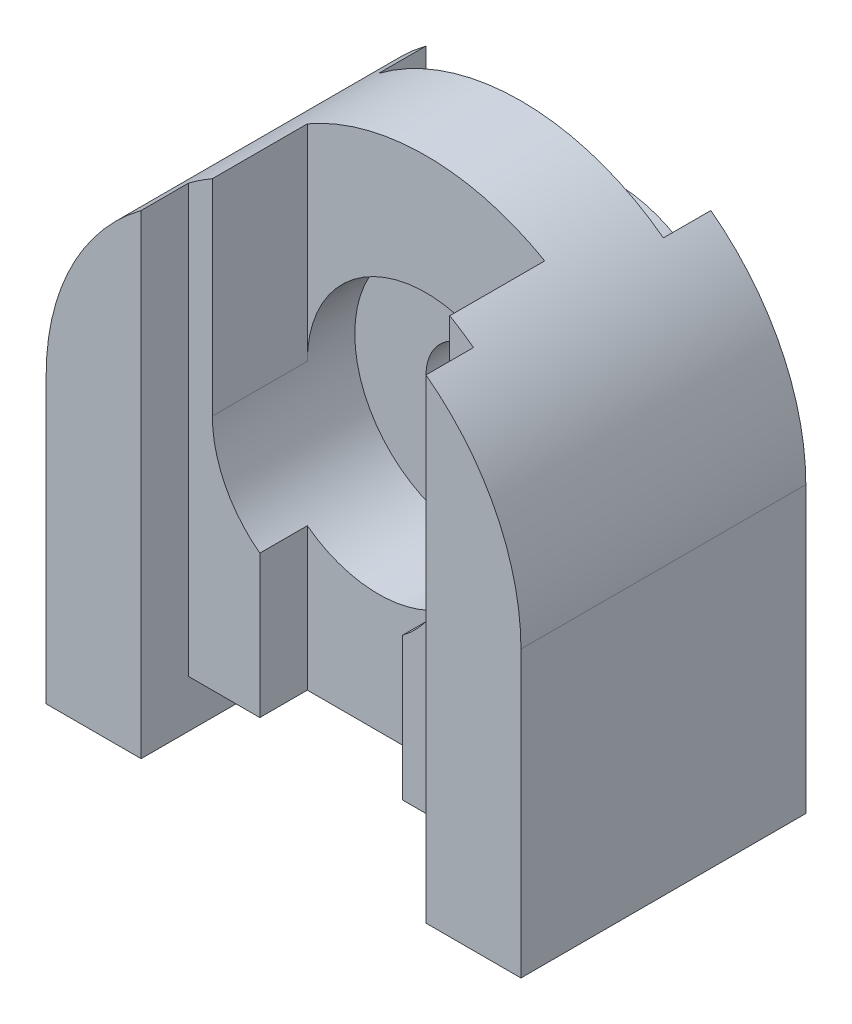
ISO-10303-21;
HEADER;
FILE_DESCRIPTION(('STEP AP214'),'2;1');
FILE_NAME('part.step','',(''),(''),'','','');
FILE_SCHEMA(('AUTOMOTIVE_DESIGN { 1 0 10303 214 1 1 1 1 }'));
ENDSEC;
DATA;
#1=APPLICATION_CONTEXT('core data for automotive mechanical design processes');
#2=APPLICATION_PROTOCOL_DEFINITION('international standard','automotive_design',2000,#1);
#3=PRODUCT_CONTEXT('',#1,'mechanical');
#4=PRODUCT('Part','Part','',(#3));
#5=PRODUCT_RELATED_PRODUCT_CATEGORY('part','',(#4));
#6=PRODUCT_DEFINITION_FORMATION('','',#4);
#7=PRODUCT_DEFINITION_CONTEXT('part definition',#1,'design');
#8=PRODUCT_DEFINITION('design','',#6,#7);
#9=PRODUCT_DEFINITION_SHAPE('','',#8);
#10=(LENGTH_UNIT() NAMED_UNIT(*) SI_UNIT(.MILLI.,.METRE.));
#11=(NAMED_UNIT(*) PLANE_ANGLE_UNIT() SI_UNIT($,.RADIAN.));
#12=(NAMED_UNIT(*) SI_UNIT($,.STERADIAN.) SOLID_ANGLE_UNIT());
#13=UNCERTAINTY_MEASURE_WITH_UNIT(LENGTH_MEASURE(1.E-05),#10,'distance_accuracy_value','');
#14=(GEOMETRIC_REPRESENTATION_CONTEXT(3) GLOBAL_UNCERTAINTY_ASSIGNED_CONTEXT((#13)) GLOBAL_UNIT_ASSIGNED_CONTEXT((#10,
#11,#12)) REPRESENTATION_CONTEXT('',''));
#15=CARTESIAN_POINT('',(0.,0.,0.));
#16=DIRECTION('',(0.,0.,1.));
#17=DIRECTION('',(1.,0.,0.));
#18=AXIS2_PLACEMENT_3D('',#15,#16,#17);
#19=CARTESIAN_POINT('',(20.,140.,60.));
#20=DIRECTION('',(0.,0.,-1.));
#21=DIRECTION('',(-1.,0.,0.));
#22=AXIS2_PLACEMENT_3D('',#19,#20,#21);
#23=PLANE('',#22);
#24=DIRECTION('',(1.,0.,0.));
#25=VECTOR('',#24,1.);
#26=CARTESIAN_POINT('',(20.,10.,60.));
#27=LINE('',#26,#25);
#28=CARTESIAN_POINT('',(20.,10.,60.));
#29=VERTEX_POINT('',#28);
#30=CARTESIAN_POINT('',(35.,10.,60.));
#31=VERTEX_POINT('',#30);
#32=EDGE_CURVE('E204',#29,#31,#27,.T.);
#33=ORIENTED_EDGE('',*,*,#32,.T.);
#34=DIRECTION('',(0.,1.,0.));
#35=VECTOR('',#34,1.);
#36=CARTESIAN_POINT('',(35.,140.,60.));
#37=LINE('',#36,#35);
#38=CARTESIAN_POINT('',(35.,40.,60.));
#39=VERTEX_POINT('',#38);
#40=EDGE_CURVE('E11',#31,#39,#37,.T.);
#41=ORIENTED_EDGE('',*,*,#40,.T.);
#42=CARTESIAN_POINT('',(50.,60.,60.));
#43=DIRECTION('',(0.,0.,-1.));
#44=DIRECTION('',(-1.,0.,0.));
#45=AXIS2_PLACEMENT_3D('',#42,#43,#44);
#46=CIRCLE('',#45,25.);
#47=CARTESIAN_POINT('',(25.,60.,60.));
#48=VERTEX_POINT('',#47);
#49=EDGE_CURVE('E212',#48,#39,#46,.F.);
#50=ORIENTED_EDGE('',*,*,#49,.F.);
#51=DIRECTION('',(0.,1.,0.));
#52=VECTOR('',#51,1.);
#53=CARTESIAN_POINT('',(25.,0.,60.));
#54=LINE('',#53,#52);
#55=CARTESIAN_POINT('',(25.,103.301270189222,60.));
#56=VERTEX_POINT('',#55);
#57=EDGE_CURVE('E216',#48,#56,#54,.T.);
#58=ORIENTED_EDGE('',*,*,#57,.T.);
#59=CARTESIAN_POINT('',(50.,60.,60.));
#60=DIRECTION('',(0.,0.,-1.));
#61=DIRECTION('',(-1.,0.,0.));
#62=AXIS2_PLACEMENT_3D('',#59,#60,#61);
#63=CIRCLE('',#62,50.);
#64=CARTESIAN_POINT('',(20.,100.,60.));
#65=VERTEX_POINT('',#64);
#66=EDGE_CURVE('E217',#65,#56,#63,.T.);
#67=ORIENTED_EDGE('',*,*,#66,.F.);
#68=DIRECTION('',(0.,-1.,0.));
#69=VECTOR('',#68,1.);
#70=CARTESIAN_POINT('',(20.,140.,60.));
#71=LINE('',#70,#69);
#72=EDGE_CURVE('E206',#65,#29,#71,.T.);
#73=ORIENTED_EDGE('',*,*,#72,.T.);
#74=EDGE_LOOP('',(#33,#41,#50,#58,#67,#73));
#75=FACE_BOUND('',#74,.T.);
#76=ADVANCED_FACE('F33',(#75),#23,.F.);
#77=CARTESIAN_POINT('',(0.,0.,70.));
#78=DIRECTION('',(0.,0.,-1.));
#79=DIRECTION('',(-1.,0.,0.));
#80=AXIS2_PLACEMENT_3D('',#77,#78,#79);
#81=PLANE('',#80);
#82=DIRECTION('',(0.,-1.,0.));
#83=VECTOR('',#82,1.);
#84=CARTESIAN_POINT('',(20.,0.,70.));
#85=LINE('',#84,#83);
#86=CARTESIAN_POINT('',(20.,100.,70.));
#87=VERTEX_POINT('',#86);
#88=CARTESIAN_POINT('',(20.,0.,70.));
#89=VERTEX_POINT('',#88);
#90=EDGE_CURVE('E302',#87,#89,#85,.T.);
#91=ORIENTED_EDGE('',*,*,#90,.F.);
#92=CARTESIAN_POINT('',(50.,60.,70.));
#93=DIRECTION('',(0.,0.,1.));
#94=DIRECTION('',(1.,0.,0.));
#95=AXIS2_PLACEMENT_3D('',#92,#93,#94);
#96=CIRCLE('',#95,50.);
#97=CARTESIAN_POINT('',(0.,60.,70.));
#98=VERTEX_POINT('',#97);
#99=EDGE_CURVE('E297',#98,#87,#96,.F.);
#100=ORIENTED_EDGE('',*,*,#99,.F.);
#101=DIRECTION('',(0.,-1.,0.));
#102=VECTOR('',#101,1.);
#103=CARTESIAN_POINT('',(0.,0.,70.));
#104=LINE('',#103,#102);
#105=CARTESIAN_POINT('',(0.,0.,70.));
#106=VERTEX_POINT('',#105);
#107=EDGE_CURVE('E311',#98,#106,#104,.T.);
#108=ORIENTED_EDGE('',*,*,#107,.T.);
#109=DIRECTION('',(1.,0.,0.));
#110=VECTOR('',#109,1.);
#111=CARTESIAN_POINT('',(0.,0.,70.));
#112=LINE('',#111,#110);
#113=EDGE_CURVE('E320',#106,#89,#112,.T.);
#114=ORIENTED_EDGE('',*,*,#113,.T.);
#115=EDGE_LOOP('',(#91,#100,#108,#114));
#116=FACE_BOUND('',#115,.T.);
#117=ADVANCED_FACE('F369',(#116),#81,.F.);
#118=CARTESIAN_POINT('',(80.,100.,70.));
#119=VERTEX_POINT('',#118);
#120=CARTESIAN_POINT('',(100.,60.,70.));
#121=VERTEX_POINT('',#120);
#122=EDGE_CURVE('E296',#119,#121,#96,.F.);
#123=ORIENTED_EDGE('',*,*,#122,.F.);
#124=DIRECTION('',(0.,1.,0.));
#125=VECTOR('',#124,1.);
#126=CARTESIAN_POINT('',(80.,0.,70.));
#127=LINE('',#126,#125);
#128=CARTESIAN_POINT('',(80.,0.,70.));
#129=VERTEX_POINT('',#128);
#130=EDGE_CURVE('E305',#129,#119,#127,.T.);
#131=ORIENTED_EDGE('',*,*,#130,.F.);
#132=CARTESIAN_POINT('',(100.,0.,70.));
#133=VERTEX_POINT('',#132);
#134=EDGE_CURVE('E319',#129,#133,#112,.T.);
#135=ORIENTED_EDGE('',*,*,#134,.T.);
#136=DIRECTION('',(0.,1.,0.));
#137=VECTOR('',#136,1.);
#138=CARTESIAN_POINT('',(100.,0.,70.));
#139=LINE('',#138,#137);
#140=EDGE_CURVE('E323',#133,#121,#139,.T.);
#141=ORIENTED_EDGE('',*,*,#140,.T.);
#142=EDGE_LOOP('',(#123,#131,#135,#141));
#143=FACE_BOUND('',#142,.T.);
#144=ADVANCED_FACE('F375',(#143),#81,.F.);
#145=CARTESIAN_POINT('',(50.,60.,0.));
#146=DIRECTION('',(0.,0.,1.));
#147=DIRECTION('',(1.,0.,0.));
#148=AXIS2_PLACEMENT_3D('',#145,#146,#147);
#149=CYLINDRICAL_SURFACE('',#148,50.);
#150=ORIENTED_EDGE('',*,*,#99,.T.);
#151=DIRECTION('',(0.,0.,1.));
#152=VECTOR('',#151,1.);
#153=CARTESIAN_POINT('',(20.,100.,0.));
#154=LINE('',#153,#152);
#155=EDGE_CURVE('E222',#87,#65,#154,.F.);
#156=ORIENTED_EDGE('',*,*,#155,.T.);
#157=ORIENTED_EDGE('',*,*,#66,.T.);
#158=DIRECTION('',(0.,0.,1.));
#159=VECTOR('',#158,1.);
#160=CARTESIAN_POINT('',(25.,103.301270189222,40.));
#161=LINE('',#160,#159);
#162=CARTESIAN_POINT('',(25.,103.301270189222,40.));
#163=VERTEX_POINT('',#162);
#164=EDGE_CURVE('E241',#163,#56,#161,.T.);
#165=ORIENTED_EDGE('',*,*,#164,.F.);
#166=CARTESIAN_POINT('',(50.,60.,40.));
#167=DIRECTION('',(0.,0.,1.));
#168=DIRECTION('',(1.,0.,0.));
#169=AXIS2_PLACEMENT_3D('',#166,#167,#168);
#170=CIRCLE('',#169,50.);
#171=CARTESIAN_POINT('',(75.,103.301270189222,40.));
#172=VERTEX_POINT('',#171);
#173=EDGE_CURVE('E231',#172,#163,#170,.T.);
#174=ORIENTED_EDGE('',*,*,#173,.F.);
#175=DIRECTION('',(0.,0.,1.));
#176=VECTOR('',#175,1.);
#177=CARTESIAN_POINT('',(75.,103.301270189222,40.));
#178=LINE('',#177,#176);
#179=CARTESIAN_POINT('',(75.,103.301270189222,60.));
#180=VERTEX_POINT('',#179);
#181=EDGE_CURVE('E244',#172,#180,#178,.T.);
#182=ORIENTED_EDGE('',*,*,#181,.T.);
#183=CARTESIAN_POINT('',(80.,100.,60.));
#184=VERTEX_POINT('',#183);
#185=EDGE_CURVE('E56',#180,#184,#63,.T.);
#186=ORIENTED_EDGE('',*,*,#185,.T.);
#187=DIRECTION('',(0.,0.,1.));
#188=VECTOR('',#187,1.);
#189=CARTESIAN_POINT('',(80.,100.,0.));
#190=LINE('',#189,#188);
#191=EDGE_CURVE('E219',#184,#119,#190,.T.);
#192=ORIENTED_EDGE('',*,*,#191,.T.);
#193=ORIENTED_EDGE('',*,*,#122,.T.);
#194=DIRECTION('',(0.,0.,1.));
#195=VECTOR('',#194,1.);
#196=CARTESIAN_POINT('',(100.,60.,0.));
#197=LINE('',#196,#195);
#198=CARTESIAN_POINT('',(100.,60.,10.));
#199=VERTEX_POINT('',#198);
#200=EDGE_CURVE('E293',#199,#121,#197,.T.);
#201=ORIENTED_EDGE('',*,*,#200,.F.);
#202=CARTESIAN_POINT('',(50.,60.,10.));
#203=DIRECTION('',(0.,0.,1.));
#204=DIRECTION('',(1.,0.,0.));
#205=AXIS2_PLACEMENT_3D('',#202,#203,#204);
#206=CIRCLE('',#205,50.);
#207=CARTESIAN_POINT('',(80.,100.,10.));
#208=VERTEX_POINT('',#207);
#209=EDGE_CURVE('E285',#199,#208,#206,.T.);
#210=ORIENTED_EDGE('',*,*,#209,.T.);
#211=DIRECTION('',(0.,0.,1.));
#212=VECTOR('',#211,1.);
#213=CARTESIAN_POINT('',(80.,100.,0.));
#214=LINE('',#213,#212);
#215=CARTESIAN_POINT('',(80.,100.,20.));
#216=VERTEX_POINT('',#215);
#217=EDGE_CURVE('E270',#208,#216,#214,.T.);
#218=ORIENTED_EDGE('',*,*,#217,.T.);
#219=CARTESIAN_POINT('',(50.,60.,20.));
#220=DIRECTION('',(0.,0.,1.));
#221=DIRECTION('',(1.,0.,0.));
#222=AXIS2_PLACEMENT_3D('',#219,#220,#221);
#223=CIRCLE('',#222,50.);
#224=CARTESIAN_POINT('',(20.,100.,20.));
#225=VERTEX_POINT('',#224);
#226=EDGE_CURVE('E266',#216,#225,#223,.T.);
#227=ORIENTED_EDGE('',*,*,#226,.T.);
#228=DIRECTION('',(0.,0.,1.));
#229=VECTOR('',#228,1.);
#230=CARTESIAN_POINT('',(20.,100.,0.));
#231=LINE('',#230,#229);
#232=CARTESIAN_POINT('',(20.,100.,10.));
#233=VERTEX_POINT('',#232);
#234=EDGE_CURVE('E273',#225,#233,#231,.F.);
#235=ORIENTED_EDGE('',*,*,#234,.T.);
#236=CARTESIAN_POINT('',(0.,60.,10.));
#237=VERTEX_POINT('',#236);
#238=EDGE_CURVE('E283',#233,#237,#206,.T.);
#239=ORIENTED_EDGE('',*,*,#238,.T.);
#240=DIRECTION('',(0.,0.,1.));
#241=VECTOR('',#240,1.);
#242=CARTESIAN_POINT('',(0.,60.,0.));
#243=LINE('',#242,#241);
#244=EDGE_CURVE('E300',#237,#98,#243,.T.);
#245=ORIENTED_EDGE('',*,*,#244,.T.);
#246=EDGE_LOOP('',(#150,#156,#157,#165,#174,#182,#186,#192,#193,#201,#210,#218,#227,#235,#239,#245));
#247=FACE_BOUND('',#246,.T.);
#248=ADVANCED_FACE('F346',(#247),#149,.T.);
#249=CARTESIAN_POINT('',(50.,60.,30.));
#250=DIRECTION('',(0.,0.,1.));
#251=DIRECTION('',(1.,0.,0.));
#252=AXIS2_PLACEMENT_3D('',#249,#250,#251);
#253=CYLINDRICAL_SURFACE('',#252,25.);
#254=ORIENTED_EDGE('',*,*,#49,.T.);
#255=DIRECTION('',(0.,0.,1.));
#256=VECTOR('',#255,1.);
#257=CARTESIAN_POINT('',(35.,40.,30.));
#258=LINE('',#257,#256);
#259=CARTESIAN_POINT('',(35.,40.,50.));
#260=VERTEX_POINT('',#259);
#261=EDGE_CURVE('E200',#39,#260,#258,.F.);
#262=ORIENTED_EDGE('',*,*,#261,.T.);
#263=CARTESIAN_POINT('',(50.,60.,50.));
#264=DIRECTION('',(0.,0.,-1.));
#265=DIRECTION('',(-1.,0.,0.));
#266=AXIS2_PLACEMENT_3D('',#263,#264,#265);
#267=CIRCLE('',#266,25.);
#268=CARTESIAN_POINT('',(65.,40.,50.));
#269=VERTEX_POINT('',#268);
#270=EDGE_CURVE('E179',#260,#269,#267,.F.);
#271=ORIENTED_EDGE('',*,*,#270,.T.);
#272=DIRECTION('',(0.,0.,1.));
#273=VECTOR('',#272,1.);
#274=CARTESIAN_POINT('',(65.,40.,30.));
#275=LINE('',#274,#273);
#276=CARTESIAN_POINT('',(65.,40.,60.));
#277=VERTEX_POINT('',#276);
#278=EDGE_CURVE('E196',#269,#277,#275,.T.);
#279=ORIENTED_EDGE('',*,*,#278,.T.);
#280=CARTESIAN_POINT('',(75.,60.,60.));
#281=VERTEX_POINT('',#280);
#282=EDGE_CURVE('E210',#277,#281,#46,.F.);
#283=ORIENTED_EDGE('',*,*,#282,.T.);
#284=DIRECTION('',(0.,0.,1.));
#285=VECTOR('',#284,1.);
#286=CARTESIAN_POINT('',(75.,60.,40.));
#287=LINE('',#286,#285);
#288=CARTESIAN_POINT('',(75.,60.,40.));
#289=VERTEX_POINT('',#288);
#290=EDGE_CURVE('E236',#289,#281,#287,.T.);
#291=ORIENTED_EDGE('',*,*,#290,.F.);
#292=CARTESIAN_POINT('',(50.,60.,40.));
#293=DIRECTION('',(0.,0.,1.));
#294=DIRECTION('',(1.,0.,0.));
#295=AXIS2_PLACEMENT_3D('',#292,#293,#294);
#296=CIRCLE('',#295,25.);
#297=CARTESIAN_POINT('',(25.,60.,40.));
#298=VERTEX_POINT('',#297);
#299=EDGE_CURVE('E225',#298,#289,#296,.F.);
#300=ORIENTED_EDGE('',*,*,#299,.F.);
#301=DIRECTION('',(0.,0.,1.));
#302=VECTOR('',#301,1.);
#303=CARTESIAN_POINT('',(25.,60.,40.));
#304=LINE('',#303,#302);
#305=EDGE_CURVE('E237',#298,#48,#304,.T.);
#306=ORIENTED_EDGE('',*,*,#305,.T.);
#307=EDGE_LOOP('',(#254,#262,#271,#279,#283,#291,#300,#306));
#308=FACE_BOUND('',#307,.T.);
#309=CARTESIAN_POINT('',(50.,60.,30.));
#310=DIRECTION('',(0.,0.,1.));
#311=DIRECTION('',(1.,0.,0.));
#312=AXIS2_PLACEMENT_3D('',#309,#310,#311);
#313=CIRCLE('',#312,25.);
#314=CARTESIAN_POINT('',(75.,60.,30.));
#315=VERTEX_POINT('',#314);
#316=EDGE_CURVE('E240',#315,#315,#313,.T.);
#317=ORIENTED_EDGE('',*,*,#316,.F.);
#318=EDGE_LOOP('',(#317));
#319=FACE_BOUND('',#318,.T.);
#320=ADVANCED_FACE('F358',(#308,#319),#253,.F.);
#321=CARTESIAN_POINT('',(20.,210.,20.));
#322=DIRECTION('',(0.,0.,1.));
#323=DIRECTION('',(1.,0.,0.));
#324=AXIS2_PLACEMENT_3D('',#321,#322,#323);
#325=PLANE('',#324);
#326=DIRECTION('',(0.,-1.,0.));
#327=VECTOR('',#326,1.);
#328=CARTESIAN_POINT('',(80.,210.,20.));
#329=LINE('',#328,#327);
#330=CARTESIAN_POINT('',(80.,10.,20.));
#331=VERTEX_POINT('',#330);
#332=EDGE_CURVE('E263',#216,#331,#329,.T.);
#333=ORIENTED_EDGE('',*,*,#332,.T.);
#334=DIRECTION('',(-1.,0.,0.));
#335=VECTOR('',#334,1.);
#336=CARTESIAN_POINT('',(20.,10.,20.));
#337=LINE('',#336,#335);
#338=CARTESIAN_POINT('',(20.,10.,20.));
#339=VERTEX_POINT('',#338);
#340=EDGE_CURVE('E260',#331,#339,#337,.T.);
#341=ORIENTED_EDGE('',*,*,#340,.T.);
#342=DIRECTION('',(0.,-1.,0.));
#343=VECTOR('',#342,1.);
#344=CARTESIAN_POINT('',(20.,210.,20.));
#345=LINE('',#344,#343);
#346=EDGE_CURVE('E264',#225,#339,#345,.T.);
#347=ORIENTED_EDGE('',*,*,#346,.F.);
#348=ORIENTED_EDGE('',*,*,#226,.F.);
#349=EDGE_LOOP('',(#333,#341,#347,#348));
#350=FACE_BOUND('',#349,.T.);
#351=CARTESIAN_POINT('',(50.,60.,20.));
#352=DIRECTION('',(0.,0.,1.));
#353=DIRECTION('',(1.,0.,0.));
#354=AXIS2_PLACEMENT_3D('',#351,#352,#353);
#355=CIRCLE('',#354,25.);
#356=CARTESIAN_POINT('',(75.,60.,20.));
#357=VERTEX_POINT('',#356);
#358=EDGE_CURVE('E332',#357,#357,#355,.F.);
#359=ORIENTED_EDGE('',*,*,#358,.F.);
#360=EDGE_LOOP('',(#359));
#361=FACE_BOUND('',#360,.T.);
#362=ADVANCED_FACE('F400',(#350,#361),#325,.F.);
#363=CARTESIAN_POINT('',(0.,185.,10.));
#364=DIRECTION('',(0.,0.,1.));
#365=DIRECTION('',(1.,0.,0.));
#366=AXIS2_PLACEMENT_3D('',#363,#364,#365);
#367=PLANE('',#366);
#368=ORIENTED_EDGE('',*,*,#238,.F.);
#369=DIRECTION('',(0.,1.,0.));
#370=VECTOR('',#369,1.);
#371=CARTESIAN_POINT('',(20.,0.,10.));
#372=LINE('',#371,#370);
#373=CARTESIAN_POINT('',(20.,0.,10.));
#374=VERTEX_POINT('',#373);
#375=EDGE_CURVE('E291',#374,#233,#372,.T.);
#376=ORIENTED_EDGE('',*,*,#375,.F.);
#377=DIRECTION('',(-1.,0.,0.));
#378=VECTOR('',#377,1.);
#379=CARTESIAN_POINT('',(0.,0.,10.));
#380=LINE('',#379,#378);
#381=CARTESIAN_POINT('',(0.,0.,10.));
#382=VERTEX_POINT('',#381);
#383=EDGE_CURVE('E276',#374,#382,#380,.T.);
#384=ORIENTED_EDGE('',*,*,#383,.T.);
#385=DIRECTION('',(0.,-1.,0.));
#386=VECTOR('',#385,1.);
#387=CARTESIAN_POINT('',(0.,185.,10.));
#388=LINE('',#387,#386);
#389=EDGE_CURVE('E280',#237,#382,#388,.T.);
#390=ORIENTED_EDGE('',*,*,#389,.F.);
#391=EDGE_LOOP('',(#368,#376,#384,#390));
#392=FACE_BOUND('',#391,.T.);
#393=ADVANCED_FACE('F412',(#392),#367,.F.);
#394=CARTESIAN_POINT('',(100.,0.,70.));
#395=DIRECTION('',(-1.,0.,0.));
#396=DIRECTION('',(0.,0.,1.));
#397=AXIS2_PLACEMENT_3D('',#394,#395,#396);
#398=PLANE('',#397);
#399=DIRECTION('',(0.,0.,-1.));
#400=VECTOR('',#399,1.);
#401=CARTESIAN_POINT('',(100.,0.,70.));
#402=LINE('',#401,#400);
#403=CARTESIAN_POINT('',(100.,0.,10.));
#404=VERTEX_POINT('',#403);
#405=EDGE_CURVE('E326',#133,#404,#402,.T.);
#406=ORIENTED_EDGE('',*,*,#405,.T.);
#407=DIRECTION('',(0.,-1.,0.));
#408=VECTOR('',#407,1.);
#409=CARTESIAN_POINT('',(100.,185.,10.));
#410=LINE('',#409,#408);
#411=EDGE_CURVE('E279',#199,#404,#410,.T.);
#412=ORIENTED_EDGE('',*,*,#411,.F.);
#413=ORIENTED_EDGE('',*,*,#200,.T.);
#414=ORIENTED_EDGE('',*,*,#140,.F.);
#415=EDGE_LOOP('',(#406,#412,#413,#414));
#416=FACE_BOUND('',#415,.T.);
#417=ADVANCED_FACE('F433',(#416),#398,.F.);
#418=CARTESIAN_POINT('',(0.,0.,70.));
#419=DIRECTION('',(0.,1.,0.));
#420=DIRECTION('',(0.,0.,1.));
#421=AXIS2_PLACEMENT_3D('',#418,#419,#420);
#422=PLANE('',#421);
#423=DIRECTION('',(0.,0.,-1.));
#424=VECTOR('',#423,1.);
#425=CARTESIAN_POINT('',(0.,0.,70.));
#426=LINE('',#425,#424);
#427=EDGE_CURVE('E329',#106,#382,#426,.T.);
#428=ORIENTED_EDGE('',*,*,#427,.T.);
#429=ORIENTED_EDGE('',*,*,#383,.F.);
#430=DIRECTION('',(0.,0.,1.));
#431=VECTOR('',#430,1.);
#432=CARTESIAN_POINT('',(20.,0.,0.));
#433=LINE('',#432,#431);
#434=EDGE_CURVE('E307',#374,#89,#433,.T.);
#435=ORIENTED_EDGE('',*,*,#434,.T.);
#436=ORIENTED_EDGE('',*,*,#113,.F.);
#437=EDGE_LOOP('',(#428,#429,#435,#436));
#438=FACE_BOUND('',#437,.T.);
#439=ADVANCED_FACE('F435',(#438),#422,.F.);
#440=CARTESIAN_POINT('',(0.,0.,70.));
#441=DIRECTION('',(1.,0.,0.));
#442=DIRECTION('',(0.,0.,-1.));
#443=AXIS2_PLACEMENT_3D('',#440,#441,#442);
#444=PLANE('',#443);
#445=ORIENTED_EDGE('',*,*,#244,.F.);
#446=ORIENTED_EDGE('',*,*,#389,.T.);
#447=ORIENTED_EDGE('',*,*,#427,.F.);
#448=ORIENTED_EDGE('',*,*,#107,.F.);
#449=EDGE_LOOP('',(#445,#446,#447,#448));
#450=FACE_BOUND('',#449,.T.);
#451=ADVANCED_FACE('F35',(#450),#444,.F.);
#452=DIRECTION('',(0.,0.,1.));
#453=VECTOR('',#452,1.);
#454=CARTESIAN_POINT('',(80.,0.,0.));
#455=LINE('',#454,#453);
#456=CARTESIAN_POINT('',(80.,0.,10.));
#457=VERTEX_POINT('',#456);
#458=EDGE_CURVE('E315',#457,#129,#455,.T.);
#459=ORIENTED_EDGE('',*,*,#458,.F.);
#460=EDGE_CURVE('E277',#404,#457,#380,.T.);
#461=ORIENTED_EDGE('',*,*,#460,.F.);
#462=ORIENTED_EDGE('',*,*,#405,.F.);
#463=ORIENTED_EDGE('',*,*,#134,.F.);
#464=EDGE_LOOP('',(#459,#461,#462,#463));
#465=FACE_BOUND('',#464,.T.);
#466=ADVANCED_FACE('F428',(#465),#422,.F.);
#467=CARTESIAN_POINT('',(20.,0.,0.));
#468=DIRECTION('',(-1.,0.,0.));
#469=DIRECTION('',(0.,0.,1.));
#470=AXIS2_PLACEMENT_3D('',#467,#468,#469);
#471=PLANE('',#470);
#472=ORIENTED_EDGE('',*,*,#434,.F.);
#473=ORIENTED_EDGE('',*,*,#375,.T.);
#474=ORIENTED_EDGE('',*,*,#234,.F.);
#475=ORIENTED_EDGE('',*,*,#346,.T.);
#476=DIRECTION('',(0.,0.,1.));
#477=VECTOR('',#476,1.);
#478=CARTESIAN_POINT('',(20.,10.,0.));
#479=LINE('',#478,#477);
#480=EDGE_CURVE('E308',#339,#29,#479,.T.);
#481=ORIENTED_EDGE('',*,*,#480,.T.);
#482=ORIENTED_EDGE('',*,*,#72,.F.);
#483=ORIENTED_EDGE('',*,*,#155,.F.);
#484=ORIENTED_EDGE('',*,*,#90,.T.);
#485=EDGE_LOOP('',(#472,#473,#474,#475,#481,#482,#483,#484));
#486=FACE_BOUND('',#485,.T.);
#487=ADVANCED_FACE('F424',(#486),#471,.F.);
#488=CARTESIAN_POINT('',(20.,10.,0.));
#489=DIRECTION('',(0.,1.,0.));
#490=DIRECTION('',(0.,0.,1.));
#491=AXIS2_PLACEMENT_3D('',#488,#489,#490);
#492=PLANE('',#491);
#493=DIRECTION('',(1.,0.,0.));
#494=VECTOR('',#493,1.);
#495=CARTESIAN_POINT('',(35.,10.,50.));
#496=LINE('',#495,#494);
#497=CARTESIAN_POINT('',(35.,10.,50.));
#498=VERTEX_POINT('',#497);
#499=CARTESIAN_POINT('',(65.,10.,50.));
#500=VERTEX_POINT('',#499);
#501=EDGE_CURVE('E177',#498,#500,#496,.T.);
#502=ORIENTED_EDGE('',*,*,#501,.F.);
#503=DIRECTION('',(0.,0.,-1.));
#504=VECTOR('',#503,1.);
#505=CARTESIAN_POINT('',(35.,10.,60.));
#506=LINE('',#505,#504);
#507=EDGE_CURVE('E185',#31,#498,#506,.T.);
#508=ORIENTED_EDGE('',*,*,#507,.F.);
#509=ORIENTED_EDGE('',*,*,#32,.F.);
#510=ORIENTED_EDGE('',*,*,#480,.F.);
#511=ORIENTED_EDGE('',*,*,#340,.F.);
#512=DIRECTION('',(0.,0.,1.));
#513=VECTOR('',#512,1.);
#514=CARTESIAN_POINT('',(80.,10.,0.));
#515=LINE('',#514,#513);
#516=CARTESIAN_POINT('',(80.,10.,60.));
#517=VERTEX_POINT('',#516);
#518=EDGE_CURVE('E312',#331,#517,#515,.T.);
#519=ORIENTED_EDGE('',*,*,#518,.T.);
#520=CARTESIAN_POINT('',(65.,10.,60.));
#521=VERTEX_POINT('',#520);
#522=EDGE_CURVE('E203',#521,#517,#27,.T.);
#523=ORIENTED_EDGE('',*,*,#522,.F.);
#524=DIRECTION('',(0.,0.,1.));
#525=VECTOR('',#524,1.);
#526=CARTESIAN_POINT('',(65.,10.,60.));
#527=LINE('',#526,#525);
#528=EDGE_CURVE('E48',#500,#521,#527,.T.);
#529=ORIENTED_EDGE('',*,*,#528,.F.);
#530=EDGE_LOOP('',(#502,#508,#509,#510,#511,#519,#523,#529));
#531=FACE_BOUND('',#530,.T.);
#532=ADVANCED_FACE('F191',(#531),#492,.F.);
#533=CARTESIAN_POINT('',(80.,0.,0.));
#534=DIRECTION('',(1.,0.,0.));
#535=DIRECTION('',(0.,0.,-1.));
#536=AXIS2_PLACEMENT_3D('',#533,#534,#535);
#537=PLANE('',#536);
#538=ORIENTED_EDGE('',*,*,#518,.F.);
#539=ORIENTED_EDGE('',*,*,#332,.F.);
#540=ORIENTED_EDGE('',*,*,#217,.F.);
#541=DIRECTION('',(0.,-1.,0.));
#542=VECTOR('',#541,1.);
#543=CARTESIAN_POINT('',(80.,0.,10.));
#544=LINE('',#543,#542);
#545=EDGE_CURVE('E288',#208,#457,#544,.T.);
#546=ORIENTED_EDGE('',*,*,#545,.T.);
#547=ORIENTED_EDGE('',*,*,#458,.T.);
#548=ORIENTED_EDGE('',*,*,#130,.T.);
#549=ORIENTED_EDGE('',*,*,#191,.F.);
#550=DIRECTION('',(0.,-1.,0.));
#551=VECTOR('',#550,1.);
#552=CARTESIAN_POINT('',(80.,140.,60.));
#553=LINE('',#552,#551);
#554=EDGE_CURVE('E207',#184,#517,#553,.T.);
#555=ORIENTED_EDGE('',*,*,#554,.T.);
#556=EDGE_LOOP('',(#538,#539,#540,#546,#547,#548,#549,#555));
#557=FACE_BOUND('',#556,.T.);
#558=ADVANCED_FACE('F343',(#557),#537,.F.);
#559=ORIENTED_EDGE('',*,*,#545,.F.);
#560=ORIENTED_EDGE('',*,*,#209,.F.);
#561=ORIENTED_EDGE('',*,*,#411,.T.);
#562=ORIENTED_EDGE('',*,*,#460,.T.);
#563=EDGE_LOOP('',(#559,#560,#561,#562));
#564=FACE_BOUND('',#563,.T.);
#565=ADVANCED_FACE('F405',(#564),#367,.F.);
#566=CARTESIAN_POINT('',(50.,60.,0.));
#567=DIRECTION('',(0.,0.,-1.));
#568=DIRECTION('',(-1.,0.,0.));
#569=AXIS2_PLACEMENT_3D('',#566,#567,#568);
#570=PLANE('',#569);
#571=CARTESIAN_POINT('',(50.,60.,0.));
#572=DIRECTION('',(0.,0.,-1.));
#573=DIRECTION('',(-1.,0.,0.));
#574=AXIS2_PLACEMENT_3D('',#571,#572,#573);
#575=CIRCLE('',#574,25.);
#576=CARTESIAN_POINT('',(25.,60.,0.));
#577=VERTEX_POINT('',#576);
#578=EDGE_CURVE('E257',#577,#577,#575,.T.);
#579=ORIENTED_EDGE('',*,*,#578,.T.);
#580=EDGE_LOOP('',(#579));
#581=FACE_BOUND('',#580,.T.);
#582=CARTESIAN_POINT('',(50.,60.,0.));
#583=DIRECTION('',(0.,0.,-1.));
#584=DIRECTION('',(-1.,0.,0.));
#585=AXIS2_PLACEMENT_3D('',#582,#583,#584);
#586=CIRCLE('',#585,10.);
#587=CARTESIAN_POINT('',(40.,60.,0.));
#588=VERTEX_POINT('',#587);
#589=EDGE_CURVE('E254',#588,#588,#586,.T.);
#590=ORIENTED_EDGE('',*,*,#589,.F.);
#591=EDGE_LOOP('',(#590));
#592=FACE_BOUND('',#591,.T.);
#593=ADVANCED_FACE('F401',(#581,#592),#570,.T.);
#594=CARTESIAN_POINT('',(50.,60.,0.));
#595=DIRECTION('',(0.,0.,1.));
#596=DIRECTION('',(1.,0.,0.));
#597=AXIS2_PLACEMENT_3D('',#594,#595,#596);
#598=CYLINDRICAL_SURFACE('',#597,25.);
#599=ORIENTED_EDGE('',*,*,#578,.F.);
#600=EDGE_LOOP('',(#599));
#601=FACE_BOUND('',#600,.T.);
#602=ORIENTED_EDGE('',*,*,#358,.T.);
#603=EDGE_LOOP('',(#602));
#604=FACE_BOUND('',#603,.T.);
#605=ADVANCED_FACE('F404',(#601,#604),#598,.T.);
#606=CARTESIAN_POINT('',(50.,60.,30.));
#607=DIRECTION('',(0.,0.,-1.));
#608=DIRECTION('',(-1.,0.,0.));
#609=AXIS2_PLACEMENT_3D('',#606,#607,#608);
#610=CYLINDRICAL_SURFACE('',#609,10.);
#611=CARTESIAN_POINT('',(50.,60.,30.));
#612=DIRECTION('',(0.,0.,1.));
#613=DIRECTION('',(1.,0.,0.));
#614=AXIS2_PLACEMENT_3D('',#611,#612,#613);
#615=CIRCLE('',#614,10.);
#616=CARTESIAN_POINT('',(60.,60.,30.));
#617=VERTEX_POINT('',#616);
#618=EDGE_CURVE('E251',#617,#617,#615,.F.);
#619=ORIENTED_EDGE('',*,*,#618,.F.);
#620=EDGE_LOOP('',(#619));
#621=FACE_BOUND('',#620,.T.);
#622=ORIENTED_EDGE('',*,*,#589,.T.);
#623=EDGE_LOOP('',(#622));
#624=FACE_BOUND('',#623,.T.);
#625=ADVANCED_FACE('F396',(#621,#624),#610,.F.);
#626=CARTESIAN_POINT('',(50.,60.,30.));
#627=DIRECTION('',(0.,0.,1.));
#628=DIRECTION('',(1.,0.,0.));
#629=AXIS2_PLACEMENT_3D('',#626,#627,#628);
#630=PLANE('',#629);
#631=ORIENTED_EDGE('',*,*,#316,.T.);
#632=EDGE_LOOP('',(#631));
#633=FACE_BOUND('',#632,.T.);
#634=ORIENTED_EDGE('',*,*,#618,.T.);
#635=EDGE_LOOP('',(#634));
#636=FACE_BOUND('',#635,.T.);
#637=ADVANCED_FACE('F391',(#633,#636),#630,.T.);
#638=CARTESIAN_POINT('',(25.,0.,40.));
#639=DIRECTION('',(1.,0.,0.));
#640=DIRECTION('',(0.,0.,-1.));
#641=AXIS2_PLACEMENT_3D('',#638,#639,#640);
#642=PLANE('',#641);
#643=ORIENTED_EDGE('',*,*,#57,.F.);
#644=ORIENTED_EDGE('',*,*,#305,.F.);
#645=DIRECTION('',(0.,1.,0.));
#646=VECTOR('',#645,1.);
#647=CARTESIAN_POINT('',(25.,0.,40.));
#648=LINE('',#647,#646);
#649=EDGE_CURVE('E234',#298,#163,#648,.T.);
#650=ORIENTED_EDGE('',*,*,#649,.T.);
#651=ORIENTED_EDGE('',*,*,#164,.T.);
#652=EDGE_LOOP('',(#643,#644,#650,#651));
#653=FACE_BOUND('',#652,.T.);
#654=ADVANCED_FACE('F387',(#653),#642,.T.);
#655=CARTESIAN_POINT('',(75.,0.,40.));
#656=DIRECTION('',(1.,0.,0.));
#657=DIRECTION('',(0.,0.,-1.));
#658=AXIS2_PLACEMENT_3D('',#655,#656,#657);
#659=PLANE('',#658);
#660=ORIENTED_EDGE('',*,*,#290,.T.);
#661=DIRECTION('',(0.,1.,0.));
#662=VECTOR('',#661,1.);
#663=CARTESIAN_POINT('',(75.,0.,60.));
#664=LINE('',#663,#662);
#665=EDGE_CURVE('E335',#281,#180,#664,.T.);
#666=ORIENTED_EDGE('',*,*,#665,.T.);
#667=ORIENTED_EDGE('',*,*,#181,.F.);
#668=DIRECTION('',(0.,1.,0.));
#669=VECTOR('',#668,1.);
#670=CARTESIAN_POINT('',(75.,0.,40.));
#671=LINE('',#670,#669);
#672=EDGE_CURVE('E228',#289,#172,#671,.T.);
#673=ORIENTED_EDGE('',*,*,#672,.F.);
#674=EDGE_LOOP('',(#660,#666,#667,#673));
#675=FACE_BOUND('',#674,.T.);
#676=ADVANCED_FACE('F351',(#675),#659,.F.);
#677=CARTESIAN_POINT('',(0.,0.,40.));
#678=DIRECTION('',(0.,0.,1.));
#679=DIRECTION('',(1.,0.,0.));
#680=AXIS2_PLACEMENT_3D('',#677,#678,#679);
#681=PLANE('',#680);
#682=ORIENTED_EDGE('',*,*,#299,.T.);
#683=ORIENTED_EDGE('',*,*,#672,.T.);
#684=ORIENTED_EDGE('',*,*,#173,.T.);
#685=ORIENTED_EDGE('',*,*,#649,.F.);
#686=EDGE_LOOP('',(#682,#683,#684,#685));
#687=FACE_BOUND('',#686,.T.);
#688=ADVANCED_FACE('F353',(#687),#681,.T.);
#689=ORIENTED_EDGE('',*,*,#282,.F.);
#690=DIRECTION('',(0.,-1.,0.));
#691=VECTOR('',#690,1.);
#692=CARTESIAN_POINT('',(65.,140.,60.));
#693=LINE('',#692,#691);
#694=EDGE_CURVE('E41',#277,#521,#693,.T.);
#695=ORIENTED_EDGE('',*,*,#694,.T.);
#696=ORIENTED_EDGE('',*,*,#522,.T.);
#697=ORIENTED_EDGE('',*,*,#554,.F.);
#698=ORIENTED_EDGE('',*,*,#185,.F.);
#699=ORIENTED_EDGE('',*,*,#665,.F.);
#700=EDGE_LOOP('',(#689,#695,#696,#697,#698,#699));
#701=FACE_BOUND('',#700,.T.);
#702=ADVANCED_FACE('F337',(#701),#23,.F.);
#703=CARTESIAN_POINT('',(35.,140.,50.));
#704=DIRECTION('',(0.,0.,-1.));
#705=DIRECTION('',(-1.,0.,0.));
#706=AXIS2_PLACEMENT_3D('',#703,#704,#705);
#707=PLANE('',#706);
#708=DIRECTION('',(0.,-1.,0.));
#709=VECTOR('',#708,1.);
#710=CARTESIAN_POINT('',(35.,140.,50.));
#711=LINE('',#710,#709);
#712=EDGE_CURVE('E172',#260,#498,#711,.T.);
#713=ORIENTED_EDGE('',*,*,#712,.T.);
#714=ORIENTED_EDGE('',*,*,#501,.T.);
#715=DIRECTION('',(0.,-1.,0.));
#716=VECTOR('',#715,1.);
#717=CARTESIAN_POINT('',(65.,140.,50.));
#718=LINE('',#717,#716);
#719=EDGE_CURVE('E182',#269,#500,#718,.T.);
#720=ORIENTED_EDGE('',*,*,#719,.F.);
#721=ORIENTED_EDGE('',*,*,#270,.F.);
#722=EDGE_LOOP('',(#713,#714,#720,#721));
#723=FACE_BOUND('',#722,.T.);
#724=ADVANCED_FACE('F174',(#723),#707,.F.);
#725=CARTESIAN_POINT('',(35.,140.,60.));
#726=DIRECTION('',(-1.,0.,0.));
#727=DIRECTION('',(0.,0.,1.));
#728=AXIS2_PLACEMENT_3D('',#725,#726,#727);
#729=PLANE('',#728);
#730=ORIENTED_EDGE('',*,*,#40,.F.);
#731=ORIENTED_EDGE('',*,*,#507,.T.);
#732=ORIENTED_EDGE('',*,*,#712,.F.);
#733=ORIENTED_EDGE('',*,*,#261,.F.);
#734=EDGE_LOOP('',(#730,#731,#732,#733));
#735=FACE_BOUND('',#734,.T.);
#736=ADVANCED_FACE('F186',(#735),#729,.F.);
#737=CARTESIAN_POINT('',(65.,140.,60.));
#738=DIRECTION('',(1.,0.,0.));
#739=DIRECTION('',(0.,0.,-1.));
#740=AXIS2_PLACEMENT_3D('',#737,#738,#739);
#741=PLANE('',#740);
#742=ORIENTED_EDGE('',*,*,#719,.T.);
#743=ORIENTED_EDGE('',*,*,#528,.T.);
#744=ORIENTED_EDGE('',*,*,#694,.F.);
#745=ORIENTED_EDGE('',*,*,#278,.F.);
#746=EDGE_LOOP('',(#742,#743,#744,#745));
#747=FACE_BOUND('',#746,.T.);
#748=ADVANCED_FACE('F360',(#747),#741,.F.);
#749=CLOSED_SHELL('',(#76,#117,#144,#248,#320,#362,#393,#417,#439,#451,#466,#487,#532,#558,#565,
#593,#605,#625,#637,#654,#676,#688,#702,#724,#736,#748));
#750=MANIFOLD_SOLID_BREP('B2',#749);
#751=ADVANCED_BREP_SHAPE_REPRESENTATION('',(#18,#750),#14);
#752=SHAPE_DEFINITION_REPRESENTATION(#9,#751);
ENDSEC;
END-ISO-10303-21;
